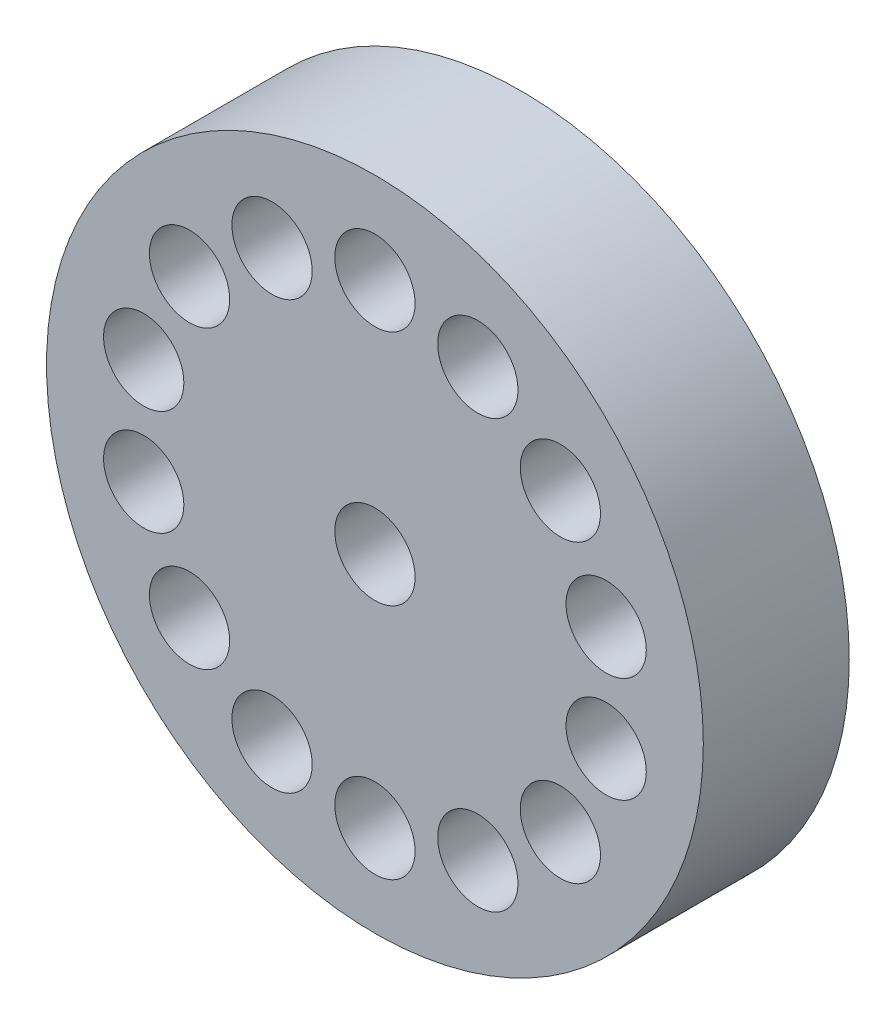
ISO-10303-21;
HEADER;
FILE_DESCRIPTION(('STEP AP214'),'2;1');
FILE_NAME('part.step','',(''),(''),'','','');
FILE_SCHEMA(('AUTOMOTIVE_DESIGN { 1 0 10303 214 1 1 1 1 }'));
ENDSEC;
DATA;
#1=APPLICATION_CONTEXT('core data for automotive mechanical design processes');
#2=APPLICATION_PROTOCOL_DEFINITION('international standard','automotive_design',2000,#1);
#3=PRODUCT_CONTEXT('',#1,'mechanical');
#4=PRODUCT('Part','Part','',(#3));
#5=PRODUCT_RELATED_PRODUCT_CATEGORY('part','',(#4));
#6=PRODUCT_DEFINITION_FORMATION('','',#4);
#7=PRODUCT_DEFINITION_CONTEXT('part definition',#1,'design');
#8=PRODUCT_DEFINITION('design','',#6,#7);
#9=PRODUCT_DEFINITION_SHAPE('','',#8);
#10=(LENGTH_UNIT() NAMED_UNIT(*) SI_UNIT(.MILLI.,.METRE.));
#11=(NAMED_UNIT(*) PLANE_ANGLE_UNIT() SI_UNIT($,.RADIAN.));
#12=(NAMED_UNIT(*) SI_UNIT($,.STERADIAN.) SOLID_ANGLE_UNIT());
#13=UNCERTAINTY_MEASURE_WITH_UNIT(LENGTH_MEASURE(1.E-05),#10,'distance_accuracy_value','');
#14=(GEOMETRIC_REPRESENTATION_CONTEXT(3) GLOBAL_UNCERTAINTY_ASSIGNED_CONTEXT((#13)) GLOBAL_UNIT_ASSIGNED_CONTEXT((#10,
#11,#12)) REPRESENTATION_CONTEXT('',''));
#15=CARTESIAN_POINT('',(0.,0.,0.));
#16=DIRECTION('',(0.,0.,1.));
#17=DIRECTION('',(1.,0.,0.));
#18=AXIS2_PLACEMENT_3D('',#15,#16,#17);
#19=CARTESIAN_POINT('',(0.,0.,2.));
#20=DIRECTION('',(0.,0.,1.));
#21=DIRECTION('',(1.,0.,0.));
#22=AXIS2_PLACEMENT_3D('',#19,#20,#21);
#23=PLANE('',#22);
#24=CARTESIAN_POINT('',(1.41012215213208,2.92814882068293,2.));
#25=DIRECTION('',(0.,0.,1.));
#26=DIRECTION('',(1.,0.,0.));
#27=AXIS2_PLACEMENT_3D('',#24,#25,#26);
#28=CIRCLE('',#27,0.55);
#29=CARTESIAN_POINT('',(1.96012215213208,2.92814882068293,2.));
#30=VERTEX_POINT('',#29);
#31=EDGE_CURVE('E99',#30,#30,#28,.T.);
#32=ORIENTED_EDGE('',*,*,#31,.F.);
#33=EDGE_LOOP('',(#32));
#34=FACE_BOUND('',#33,.T.);
#35=CARTESIAN_POINT('',(2.54095231802115,2.026341856041,2.));
#36=DIRECTION('',(0.,0.,1.));
#37=DIRECTION('',(1.,0.,0.));
#38=AXIS2_PLACEMENT_3D('',#35,#36,#37);
#39=CIRCLE('',#38,0.55);
#40=CARTESIAN_POINT('',(3.09095231802115,2.026341856041,2.));
#41=VERTEX_POINT('',#40);
#42=EDGE_CURVE('E93',#41,#41,#39,.T.);
#43=ORIENTED_EDGE('',*,*,#42,.F.);
#44=EDGE_LOOP('',(#43));
#45=FACE_BOUND('',#44,.T.);
#46=CARTESIAN_POINT('',(3.16851571459105,0.723193035358172,2.));
#47=DIRECTION('',(0.,0.,1.));
#48=DIRECTION('',(1.,0.,0.));
#49=AXIS2_PLACEMENT_3D('',#46,#47,#48);
#50=CIRCLE('',#49,0.55);
#51=CARTESIAN_POINT('',(3.71851571459105,0.723193035358172,2.));
#52=VERTEX_POINT('',#51);
#53=EDGE_CURVE('E87',#52,#52,#50,.T.);
#54=ORIENTED_EDGE('',*,*,#53,.F.);
#55=EDGE_LOOP('',(#54));
#56=FACE_BOUND('',#55,.T.);
#57=CARTESIAN_POINT('',(3.16851571459111,-0.723193035357872,2.));
#58=DIRECTION('',(0.,0.,1.));
#59=DIRECTION('',(1.,0.,0.));
#60=AXIS2_PLACEMENT_3D('',#57,#58,#59);
#61=CIRCLE('',#60,0.55);
#62=CARTESIAN_POINT('',(3.71851571459111,-0.723193035357872,2.));
#63=VERTEX_POINT('',#62);
#64=EDGE_CURVE('E81',#63,#63,#61,.T.);
#65=ORIENTED_EDGE('',*,*,#64,.F.);
#66=EDGE_LOOP('',(#65));
#67=FACE_BOUND('',#66,.T.);
#68=CARTESIAN_POINT('',(2.54095231802135,-2.02634185604076,2.));
#69=DIRECTION('',(0.,0.,1.));
#70=DIRECTION('',(1.,0.,0.));
#71=AXIS2_PLACEMENT_3D('',#68,#69,#70);
#72=CIRCLE('',#71,0.55);
#73=CARTESIAN_POINT('',(3.09095231802135,-2.02634185604076,2.));
#74=VERTEX_POINT('',#73);
#75=EDGE_CURVE('E75',#74,#74,#72,.T.);
#76=ORIENTED_EDGE('',*,*,#75,.F.);
#77=EDGE_LOOP('',(#76));
#78=FACE_BOUND('',#77,.T.);
#79=CARTESIAN_POINT('',(1.41012215213236,-2.9281488206828,2.));
#80=DIRECTION('',(0.,0.,1.));
#81=DIRECTION('',(1.,0.,0.));
#82=AXIS2_PLACEMENT_3D('',#79,#80,#81);
#83=CIRCLE('',#82,0.55);
#84=CARTESIAN_POINT('',(1.96012215213236,-2.9281488206828,2.));
#85=VERTEX_POINT('',#84);
#86=EDGE_CURVE('E69',#85,#85,#83,.T.);
#87=ORIENTED_EDGE('',*,*,#86,.F.);
#88=EDGE_LOOP('',(#87));
#89=FACE_BOUND('',#88,.T.);
#90=CARTESIAN_POINT('',(3.07708362406603E-13,-3.25,2.));
#91=DIRECTION('',(0.,0.,1.));
#92=DIRECTION('',(1.,0.,0.));
#93=AXIS2_PLACEMENT_3D('',#90,#91,#92);
#94=CIRCLE('',#93,0.55);
#95=CARTESIAN_POINT('',(0.550000000000308,-3.25,2.));
#96=VERTEX_POINT('',#95);
#97=EDGE_CURVE('E63',#96,#96,#94,.T.);
#98=ORIENTED_EDGE('',*,*,#97,.F.);
#99=EDGE_LOOP('',(#98));
#100=FACE_BOUND('',#99,.T.);
#101=CARTESIAN_POINT('',(-1.41012215213177,-2.92814882068293,2.));
#102=DIRECTION('',(0.,0.,1.));
#103=DIRECTION('',(1.,0.,0.));
#104=AXIS2_PLACEMENT_3D('',#101,#102,#103);
#105=CIRCLE('',#104,0.55);
#106=CARTESIAN_POINT('',(-0.860122152131771,-2.92814882068293,2.));
#107=VERTEX_POINT('',#106);
#108=EDGE_CURVE('E56',#107,#107,#105,.T.);
#109=ORIENTED_EDGE('',*,*,#108,.F.);
#110=EDGE_LOOP('',(#109));
#111=FACE_BOUND('',#110,.T.);
#112=CARTESIAN_POINT('',(-2.54095231802085,-2.026341856041,2.));
#113=DIRECTION('',(0.,0.,1.));
#114=DIRECTION('',(1.,0.,0.));
#115=AXIS2_PLACEMENT_3D('',#112,#113,#114);
#116=CIRCLE('',#115,0.55);
#117=CARTESIAN_POINT('',(-1.99095231802085,-2.026341856041,2.));
#118=VERTEX_POINT('',#117);
#119=EDGE_CURVE('E128',#118,#118,#116,.T.);
#120=ORIENTED_EDGE('',*,*,#119,.F.);
#121=EDGE_LOOP('',(#120));
#122=FACE_BOUND('',#121,.T.);
#123=CARTESIAN_POINT('',(-3.16851571459074,-0.723193035358172,2.));
#124=DIRECTION('',(0.,0.,1.));
#125=DIRECTION('',(1.,0.,0.));
#126=AXIS2_PLACEMENT_3D('',#123,#124,#125);
#127=CIRCLE('',#126,0.55);
#128=CARTESIAN_POINT('',(-2.61851571459074,-0.723193035358172,2.));
#129=VERTEX_POINT('',#128);
#130=EDGE_CURVE('E122',#129,#129,#127,.T.);
#131=ORIENTED_EDGE('',*,*,#130,.F.);
#132=EDGE_LOOP('',(#131));
#133=FACE_BOUND('',#132,.T.);
#134=CARTESIAN_POINT('',(-3.16851571459081,0.723193035357871,2.));
#135=DIRECTION('',(0.,0.,1.));
#136=DIRECTION('',(1.,0.,0.));
#137=AXIS2_PLACEMENT_3D('',#134,#135,#136);
#138=CIRCLE('',#137,0.55);
#139=CARTESIAN_POINT('',(-2.61851571459081,0.723193035357871,2.));
#140=VERTEX_POINT('',#139);
#141=EDGE_CURVE('E116',#140,#140,#138,.T.);
#142=ORIENTED_EDGE('',*,*,#141,.F.);
#143=EDGE_LOOP('',(#142));
#144=FACE_BOUND('',#143,.T.);
#145=CARTESIAN_POINT('',(-2.54095231802104,2.02634185604076,2.));
#146=DIRECTION('',(0.,0.,1.));
#147=DIRECTION('',(1.,0.,0.));
#148=AXIS2_PLACEMENT_3D('',#145,#146,#147);
#149=CIRCLE('',#148,0.55);
#150=CARTESIAN_POINT('',(-1.99095231802104,2.02634185604076,2.));
#151=VERTEX_POINT('',#150);
#152=EDGE_CURVE('E110',#151,#151,#149,.T.);
#153=ORIENTED_EDGE('',*,*,#152,.F.);
#154=EDGE_LOOP('',(#153));
#155=FACE_BOUND('',#154,.T.);
#156=CARTESIAN_POINT('',(-1.41012215213205,2.92814882068279,2.));
#157=DIRECTION('',(0.,0.,1.));
#158=DIRECTION('',(1.,0.,0.));
#159=AXIS2_PLACEMENT_3D('',#156,#157,#158);
#160=CIRCLE('',#159,0.55);
#161=CARTESIAN_POINT('',(-0.860122152132049,2.92814882068279,2.));
#162=VERTEX_POINT('',#161);
#163=EDGE_CURVE('E104',#162,#162,#160,.T.);
#164=ORIENTED_EDGE('',*,*,#163,.F.);
#165=EDGE_LOOP('',(#164));
#166=FACE_BOUND('',#165,.T.);
#167=CARTESIAN_POINT('',(0.,3.25,2.));
#168=DIRECTION('',(0.,0.,1.));
#169=DIRECTION('',(1.,0.,0.));
#170=AXIS2_PLACEMENT_3D('',#167,#168,#169);
#171=CIRCLE('',#170,0.55);
#172=CARTESIAN_POINT('',(0.55,3.25,2.));
#173=VERTEX_POINT('',#172);
#174=EDGE_CURVE('E50',#173,#173,#171,.T.);
#175=ORIENTED_EDGE('',*,*,#174,.F.);
#176=EDGE_LOOP('',(#175));
#177=FACE_BOUND('',#176,.T.);
#178=CARTESIAN_POINT('',(0.,0.,2.));
#179=DIRECTION('',(0.,0.,1.));
#180=DIRECTION('',(1.,0.,0.));
#181=AXIS2_PLACEMENT_3D('',#178,#179,#180);
#182=CIRCLE('',#181,4.5);
#183=CARTESIAN_POINT('',(4.5,0.,2.));
#184=VERTEX_POINT('',#183);
#185=EDGE_CURVE('E10',#184,#184,#182,.T.);
#186=ORIENTED_EDGE('',*,*,#185,.T.);
#187=EDGE_LOOP('',(#186));
#188=FACE_BOUND('',#187,.T.);
#189=CARTESIAN_POINT('',(0.,0.,2.));
#190=DIRECTION('',(0.,0.,1.));
#191=DIRECTION('',(1.,0.,0.));
#192=AXIS2_PLACEMENT_3D('',#189,#190,#191);
#193=CIRCLE('',#192,0.55);
#194=CARTESIAN_POINT('',(0.55,0.,2.));
#195=VERTEX_POINT('',#194);
#196=EDGE_CURVE('E42',#195,#195,#193,.T.);
#197=ORIENTED_EDGE('',*,*,#196,.F.);
#198=EDGE_LOOP('',(#197));
#199=FACE_BOUND('',#198,.T.);
#200=ADVANCED_FACE('F31',(#34,#45,#56,#67,#78,#89,#100,#111,#122,#133,#144,#155,#166,#177,#188,
#199),#23,.T.);
#201=CARTESIAN_POINT('',(0.,0.,0.));
#202=DIRECTION('',(0.,0.,1.));
#203=DIRECTION('',(1.,0.,0.));
#204=AXIS2_PLACEMENT_3D('',#201,#202,#203);
#205=PLANE('',#204);
#206=CARTESIAN_POINT('',(0.,0.,0.));
#207=DIRECTION('',(0.,0.,1.));
#208=DIRECTION('',(1.,0.,0.));
#209=AXIS2_PLACEMENT_3D('',#206,#207,#208);
#210=CIRCLE('',#209,4.5);
#211=CARTESIAN_POINT('',(4.5,0.,0.));
#212=VERTEX_POINT('',#211);
#213=EDGE_CURVE('E35',#212,#212,#210,.T.);
#214=ORIENTED_EDGE('',*,*,#213,.F.);
#215=EDGE_LOOP('',(#214));
#216=FACE_BOUND('',#215,.T.);
#217=CARTESIAN_POINT('',(0.,0.,0.));
#218=DIRECTION('',(0.,0.,1.));
#219=DIRECTION('',(1.,0.,0.));
#220=AXIS2_PLACEMENT_3D('',#217,#218,#219);
#221=CIRCLE('',#220,0.55);
#222=CARTESIAN_POINT('',(0.55,0.,0.));
#223=VERTEX_POINT('',#222);
#224=EDGE_CURVE('E44',#223,#223,#221,.T.);
#225=ORIENTED_EDGE('',*,*,#224,.T.);
#226=EDGE_LOOP('',(#225));
#227=FACE_BOUND('',#226,.T.);
#228=ADVANCED_FACE('F145',(#216,#227),#205,.F.);
#229=CARTESIAN_POINT('',(0.,0.,2.));
#230=DIRECTION('',(0.,0.,-1.));
#231=DIRECTION('',(-1.,0.,0.));
#232=AXIS2_PLACEMENT_3D('',#229,#230,#231);
#233=CYLINDRICAL_SURFACE('',#232,4.5);
#234=ORIENTED_EDGE('',*,*,#185,.F.);
#235=EDGE_LOOP('',(#234));
#236=FACE_BOUND('',#235,.T.);
#237=ORIENTED_EDGE('',*,*,#213,.T.);
#238=EDGE_LOOP('',(#237));
#239=FACE_BOUND('',#238,.T.);
#240=ADVANCED_FACE('F33',(#236,#239),#233,.T.);
#241=CARTESIAN_POINT('',(0.,0.,2.));
#242=DIRECTION('',(0.,0.,-1.));
#243=DIRECTION('',(-1.,0.,0.));
#244=AXIS2_PLACEMENT_3D('',#241,#242,#243);
#245=CYLINDRICAL_SURFACE('',#244,0.55);
#246=ORIENTED_EDGE('',*,*,#196,.T.);
#247=EDGE_LOOP('',(#246));
#248=FACE_BOUND('',#247,.T.);
#249=ORIENTED_EDGE('',*,*,#224,.F.);
#250=EDGE_LOOP('',(#249));
#251=FACE_BOUND('',#250,.T.);
#252=ADVANCED_FACE('F160',(#248,#251),#245,.F.);
#253=CARTESIAN_POINT('',(0.,3.25,1.));
#254=DIRECTION('',(0.,0.,1.));
#255=DIRECTION('',(1.,0.,0.));
#256=AXIS2_PLACEMENT_3D('',#253,#254,#255);
#257=CYLINDRICAL_SURFACE('',#256,0.55);
#258=CARTESIAN_POINT('',(0.,3.25,1.));
#259=DIRECTION('',(0.,0.,1.));
#260=DIRECTION('',(1.,0.,0.));
#261=AXIS2_PLACEMENT_3D('',#258,#259,#260);
#262=CIRCLE('',#261,0.55);
#263=CARTESIAN_POINT('',(0.55,3.25,1.));
#264=VERTEX_POINT('',#263);
#265=EDGE_CURVE('E47',#264,#264,#262,.T.);
#266=ORIENTED_EDGE('',*,*,#265,.F.);
#267=EDGE_LOOP('',(#266));
#268=FACE_BOUND('',#267,.T.);
#269=ORIENTED_EDGE('',*,*,#174,.T.);
#270=EDGE_LOOP('',(#269));
#271=FACE_BOUND('',#270,.T.);
#272=ADVANCED_FACE('F163',(#268,#271),#257,.F.);
#273=CARTESIAN_POINT('',(0.,3.25,1.));
#274=DIRECTION('',(0.,0.,1.));
#275=DIRECTION('',(1.,0.,0.));
#276=AXIS2_PLACEMENT_3D('',#273,#274,#275);
#277=PLANE('',#276);
#278=ORIENTED_EDGE('',*,*,#265,.T.);
#279=EDGE_LOOP('',(#278));
#280=FACE_BOUND('',#279,.T.);
#281=ADVANCED_FACE('F177',(#280),#277,.T.);
#282=CARTESIAN_POINT('',(-1.41012215213205,2.92814882068279,1.));
#283=DIRECTION('',(0.,0.,1.));
#284=DIRECTION('',(1.,0.,0.));
#285=AXIS2_PLACEMENT_3D('',#282,#283,#284);
#286=CYLINDRICAL_SURFACE('',#285,0.55);
#287=CARTESIAN_POINT('',(-1.41012215213205,2.92814882068279,1.));
#288=DIRECTION('',(0.,0.,1.));
#289=DIRECTION('',(1.,0.,0.));
#290=AXIS2_PLACEMENT_3D('',#287,#288,#289);
#291=CIRCLE('',#290,0.55);
#292=CARTESIAN_POINT('',(-0.860122152132049,2.92814882068279,1.));
#293=VERTEX_POINT('',#292);
#294=EDGE_CURVE('E107',#293,#293,#291,.T.);
#295=ORIENTED_EDGE('',*,*,#294,.F.);
#296=EDGE_LOOP('',(#295));
#297=FACE_BOUND('',#296,.T.);
#298=ORIENTED_EDGE('',*,*,#163,.T.);
#299=EDGE_LOOP('',(#298));
#300=FACE_BOUND('',#299,.T.);
#301=ADVANCED_FACE('F181',(#297,#300),#286,.F.);
#302=CARTESIAN_POINT('',(-1.41012215213205,2.92814882068279,1.));
#303=DIRECTION('',(0.,0.,1.));
#304=DIRECTION('',(1.,0.,0.));
#305=AXIS2_PLACEMENT_3D('',#302,#303,#304);
#306=PLANE('',#305);
#307=ORIENTED_EDGE('',*,*,#294,.T.);
#308=EDGE_LOOP('',(#307));
#309=FACE_BOUND('',#308,.T.);
#310=ADVANCED_FACE('F249',(#309),#306,.T.);
#311=CARTESIAN_POINT('',(-2.54095231802104,2.02634185604076,1.));
#312=DIRECTION('',(0.,0.,1.));
#313=DIRECTION('',(1.,0.,0.));
#314=AXIS2_PLACEMENT_3D('',#311,#312,#313);
#315=CYLINDRICAL_SURFACE('',#314,0.55);
#316=CARTESIAN_POINT('',(-2.54095231802104,2.02634185604076,1.));
#317=DIRECTION('',(0.,0.,1.));
#318=DIRECTION('',(1.,0.,0.));
#319=AXIS2_PLACEMENT_3D('',#316,#317,#318);
#320=CIRCLE('',#319,0.55);
#321=CARTESIAN_POINT('',(-1.99095231802104,2.02634185604076,1.));
#322=VERTEX_POINT('',#321);
#323=EDGE_CURVE('E113',#322,#322,#320,.T.);
#324=ORIENTED_EDGE('',*,*,#323,.F.);
#325=EDGE_LOOP('',(#324));
#326=FACE_BOUND('',#325,.T.);
#327=ORIENTED_EDGE('',*,*,#152,.T.);
#328=EDGE_LOOP('',(#327));
#329=FACE_BOUND('',#328,.T.);
#330=ADVANCED_FACE('F253',(#326,#329),#315,.F.);
#331=CARTESIAN_POINT('',(-2.54095231802104,2.02634185604076,1.));
#332=DIRECTION('',(0.,0.,1.));
#333=DIRECTION('',(1.,0.,0.));
#334=AXIS2_PLACEMENT_3D('',#331,#332,#333);
#335=PLANE('',#334);
#336=ORIENTED_EDGE('',*,*,#323,.T.);
#337=EDGE_LOOP('',(#336));
#338=FACE_BOUND('',#337,.T.);
#339=ADVANCED_FACE('F257',(#338),#335,.T.);
#340=CARTESIAN_POINT('',(-3.16851571459081,0.723193035357871,1.));
#341=DIRECTION('',(0.,0.,1.));
#342=DIRECTION('',(1.,0.,0.));
#343=AXIS2_PLACEMENT_3D('',#340,#341,#342);
#344=CYLINDRICAL_SURFACE('',#343,0.55);
#345=CARTESIAN_POINT('',(-3.16851571459081,0.723193035357871,1.));
#346=DIRECTION('',(0.,0.,1.));
#347=DIRECTION('',(1.,0.,0.));
#348=AXIS2_PLACEMENT_3D('',#345,#346,#347);
#349=CIRCLE('',#348,0.55);
#350=CARTESIAN_POINT('',(-2.61851571459081,0.723193035357871,1.));
#351=VERTEX_POINT('',#350);
#352=EDGE_CURVE('E119',#351,#351,#349,.T.);
#353=ORIENTED_EDGE('',*,*,#352,.F.);
#354=EDGE_LOOP('',(#353));
#355=FACE_BOUND('',#354,.T.);
#356=ORIENTED_EDGE('',*,*,#141,.T.);
#357=EDGE_LOOP('',(#356));
#358=FACE_BOUND('',#357,.T.);
#359=ADVANCED_FACE('F261',(#355,#358),#344,.F.);
#360=CARTESIAN_POINT('',(-3.16851571459081,0.723193035357871,1.));
#361=DIRECTION('',(0.,0.,1.));
#362=DIRECTION('',(1.,0.,0.));
#363=AXIS2_PLACEMENT_3D('',#360,#361,#362);
#364=PLANE('',#363);
#365=ORIENTED_EDGE('',*,*,#352,.T.);
#366=EDGE_LOOP('',(#365));
#367=FACE_BOUND('',#366,.T.);
#368=ADVANCED_FACE('F265',(#367),#364,.T.);
#369=CARTESIAN_POINT('',(-3.16851571459074,-0.723193035358172,1.));
#370=DIRECTION('',(0.,0.,1.));
#371=DIRECTION('',(1.,0.,0.));
#372=AXIS2_PLACEMENT_3D('',#369,#370,#371);
#373=CYLINDRICAL_SURFACE('',#372,0.55);
#374=CARTESIAN_POINT('',(-3.16851571459074,-0.723193035358172,1.));
#375=DIRECTION('',(0.,0.,1.));
#376=DIRECTION('',(1.,0.,0.));
#377=AXIS2_PLACEMENT_3D('',#374,#375,#376);
#378=CIRCLE('',#377,0.55);
#379=CARTESIAN_POINT('',(-2.61851571459074,-0.723193035358172,1.));
#380=VERTEX_POINT('',#379);
#381=EDGE_CURVE('E125',#380,#380,#378,.T.);
#382=ORIENTED_EDGE('',*,*,#381,.F.);
#383=EDGE_LOOP('',(#382));
#384=FACE_BOUND('',#383,.T.);
#385=ORIENTED_EDGE('',*,*,#130,.T.);
#386=EDGE_LOOP('',(#385));
#387=FACE_BOUND('',#386,.T.);
#388=ADVANCED_FACE('F269',(#384,#387),#373,.F.);
#389=CARTESIAN_POINT('',(-3.16851571459074,-0.723193035358172,1.));
#390=DIRECTION('',(0.,0.,1.));
#391=DIRECTION('',(1.,0.,0.));
#392=AXIS2_PLACEMENT_3D('',#389,#390,#391);
#393=PLANE('',#392);
#394=ORIENTED_EDGE('',*,*,#381,.T.);
#395=EDGE_LOOP('',(#394));
#396=FACE_BOUND('',#395,.T.);
#397=ADVANCED_FACE('F139',(#396),#393,.T.);
#398=CARTESIAN_POINT('',(-2.54095231802085,-2.026341856041,1.));
#399=DIRECTION('',(0.,0.,1.));
#400=DIRECTION('',(1.,0.,0.));
#401=AXIS2_PLACEMENT_3D('',#398,#399,#400);
#402=CYLINDRICAL_SURFACE('',#401,0.55);
#403=CARTESIAN_POINT('',(-2.54095231802085,-2.026341856041,1.));
#404=DIRECTION('',(0.,0.,1.));
#405=DIRECTION('',(1.,0.,0.));
#406=AXIS2_PLACEMENT_3D('',#403,#404,#405);
#407=CIRCLE('',#406,0.55);
#408=CARTESIAN_POINT('',(-1.99095231802085,-2.026341856041,1.));
#409=VERTEX_POINT('',#408);
#410=EDGE_CURVE('E60',#409,#409,#407,.T.);
#411=ORIENTED_EDGE('',*,*,#410,.F.);
#412=EDGE_LOOP('',(#411));
#413=FACE_BOUND('',#412,.T.);
#414=ORIENTED_EDGE('',*,*,#119,.T.);
#415=EDGE_LOOP('',(#414));
#416=FACE_BOUND('',#415,.T.);
#417=ADVANCED_FACE('F136',(#413,#416),#402,.F.);
#418=CARTESIAN_POINT('',(-2.54095231802085,-2.026341856041,1.));
#419=DIRECTION('',(0.,0.,1.));
#420=DIRECTION('',(1.,0.,0.));
#421=AXIS2_PLACEMENT_3D('',#418,#419,#420);
#422=PLANE('',#421);
#423=ORIENTED_EDGE('',*,*,#410,.T.);
#424=EDGE_LOOP('',(#423));
#425=FACE_BOUND('',#424,.T.);
#426=ADVANCED_FACE('F134',(#425),#422,.T.);
#427=CARTESIAN_POINT('',(-1.41012215213177,-2.92814882068293,1.));
#428=DIRECTION('',(0.,0.,1.));
#429=DIRECTION('',(1.,0.,0.));
#430=AXIS2_PLACEMENT_3D('',#427,#428,#429);
#431=CYLINDRICAL_SURFACE('',#430,0.55);
#432=CARTESIAN_POINT('',(-1.41012215213177,-2.92814882068293,1.));
#433=DIRECTION('',(0.,0.,1.));
#434=DIRECTION('',(1.,0.,0.));
#435=AXIS2_PLACEMENT_3D('',#432,#433,#434);
#436=CIRCLE('',#435,0.55);
#437=CARTESIAN_POINT('',(-0.860122152131771,-2.92814882068293,1.));
#438=VERTEX_POINT('',#437);
#439=EDGE_CURVE('E59',#438,#438,#436,.T.);
#440=ORIENTED_EDGE('',*,*,#439,.F.);
#441=EDGE_LOOP('',(#440));
#442=FACE_BOUND('',#441,.T.);
#443=ORIENTED_EDGE('',*,*,#108,.T.);
#444=EDGE_LOOP('',(#443));
#445=FACE_BOUND('',#444,.T.);
#446=ADVANCED_FACE('F183',(#442,#445),#431,.F.);
#447=CARTESIAN_POINT('',(-1.41012215213177,-2.92814882068293,1.));
#448=DIRECTION('',(0.,0.,1.));
#449=DIRECTION('',(1.,0.,0.));
#450=AXIS2_PLACEMENT_3D('',#447,#448,#449);
#451=PLANE('',#450);
#452=ORIENTED_EDGE('',*,*,#439,.T.);
#453=EDGE_LOOP('',(#452));
#454=FACE_BOUND('',#453,.T.);
#455=ADVANCED_FACE('F186',(#454),#451,.T.);
#456=CARTESIAN_POINT('',(3.07708362406603E-13,-3.25,1.));
#457=DIRECTION('',(0.,0.,1.));
#458=DIRECTION('',(1.,0.,0.));
#459=AXIS2_PLACEMENT_3D('',#456,#457,#458);
#460=CYLINDRICAL_SURFACE('',#459,0.55);
#461=CARTESIAN_POINT('',(3.07708362406603E-13,-3.25,1.));
#462=DIRECTION('',(0.,0.,1.));
#463=DIRECTION('',(1.,0.,0.));
#464=AXIS2_PLACEMENT_3D('',#461,#462,#463);
#465=CIRCLE('',#464,0.55);
#466=CARTESIAN_POINT('',(0.550000000000308,-3.25,1.));
#467=VERTEX_POINT('',#466);
#468=EDGE_CURVE('E66',#467,#467,#465,.T.);
#469=ORIENTED_EDGE('',*,*,#468,.F.);
#470=EDGE_LOOP('',(#469));
#471=FACE_BOUND('',#470,.T.);
#472=ORIENTED_EDGE('',*,*,#97,.T.);
#473=EDGE_LOOP('',(#472));
#474=FACE_BOUND('',#473,.T.);
#475=ADVANCED_FACE('F190',(#471,#474),#460,.F.);
#476=CARTESIAN_POINT('',(3.07708362406603E-13,-3.25,1.));
#477=DIRECTION('',(0.,0.,1.));
#478=DIRECTION('',(1.,0.,0.));
#479=AXIS2_PLACEMENT_3D('',#476,#477,#478);
#480=PLANE('',#479);
#481=ORIENTED_EDGE('',*,*,#468,.T.);
#482=EDGE_LOOP('',(#481));
#483=FACE_BOUND('',#482,.T.);
#484=ADVANCED_FACE('F194',(#483),#480,.T.);
#485=CARTESIAN_POINT('',(1.41012215213236,-2.9281488206828,1.));
#486=DIRECTION('',(0.,0.,1.));
#487=DIRECTION('',(1.,0.,0.));
#488=AXIS2_PLACEMENT_3D('',#485,#486,#487);
#489=CYLINDRICAL_SURFACE('',#488,0.55);
#490=CARTESIAN_POINT('',(1.41012215213236,-2.9281488206828,1.));
#491=DIRECTION('',(0.,0.,1.));
#492=DIRECTION('',(1.,0.,0.));
#493=AXIS2_PLACEMENT_3D('',#490,#491,#492);
#494=CIRCLE('',#493,0.55);
#495=CARTESIAN_POINT('',(1.96012215213236,-2.9281488206828,1.));
#496=VERTEX_POINT('',#495);
#497=EDGE_CURVE('E72',#496,#496,#494,.T.);
#498=ORIENTED_EDGE('',*,*,#497,.F.);
#499=EDGE_LOOP('',(#498));
#500=FACE_BOUND('',#499,.T.);
#501=ORIENTED_EDGE('',*,*,#86,.T.);
#502=EDGE_LOOP('',(#501));
#503=FACE_BOUND('',#502,.T.);
#504=ADVANCED_FACE('F198',(#500,#503),#489,.F.);
#505=CARTESIAN_POINT('',(1.41012215213236,-2.9281488206828,1.));
#506=DIRECTION('',(0.,0.,1.));
#507=DIRECTION('',(1.,0.,0.));
#508=AXIS2_PLACEMENT_3D('',#505,#506,#507);
#509=PLANE('',#508);
#510=ORIENTED_EDGE('',*,*,#497,.T.);
#511=EDGE_LOOP('',(#510));
#512=FACE_BOUND('',#511,.T.);
#513=ADVANCED_FACE('F202',(#512),#509,.T.);
#514=CARTESIAN_POINT('',(2.54095231802135,-2.02634185604076,1.));
#515=DIRECTION('',(0.,0.,1.));
#516=DIRECTION('',(1.,0.,0.));
#517=AXIS2_PLACEMENT_3D('',#514,#515,#516);
#518=CYLINDRICAL_SURFACE('',#517,0.55);
#519=CARTESIAN_POINT('',(2.54095231802135,-2.02634185604076,1.));
#520=DIRECTION('',(0.,0.,1.));
#521=DIRECTION('',(1.,0.,0.));
#522=AXIS2_PLACEMENT_3D('',#519,#520,#521);
#523=CIRCLE('',#522,0.55);
#524=CARTESIAN_POINT('',(3.09095231802135,-2.02634185604076,1.));
#525=VERTEX_POINT('',#524);
#526=EDGE_CURVE('E78',#525,#525,#523,.T.);
#527=ORIENTED_EDGE('',*,*,#526,.F.);
#528=EDGE_LOOP('',(#527));
#529=FACE_BOUND('',#528,.T.);
#530=ORIENTED_EDGE('',*,*,#75,.T.);
#531=EDGE_LOOP('',(#530));
#532=FACE_BOUND('',#531,.T.);
#533=ADVANCED_FACE('F206',(#529,#532),#518,.F.);
#534=CARTESIAN_POINT('',(2.54095231802135,-2.02634185604076,1.));
#535=DIRECTION('',(0.,0.,1.));
#536=DIRECTION('',(1.,0.,0.));
#537=AXIS2_PLACEMENT_3D('',#534,#535,#536);
#538=PLANE('',#537);
#539=ORIENTED_EDGE('',*,*,#526,.T.);
#540=EDGE_LOOP('',(#539));
#541=FACE_BOUND('',#540,.T.);
#542=ADVANCED_FACE('F210',(#541),#538,.T.);
#543=CARTESIAN_POINT('',(3.16851571459111,-0.723193035357872,1.));
#544=DIRECTION('',(0.,0.,1.));
#545=DIRECTION('',(1.,0.,0.));
#546=AXIS2_PLACEMENT_3D('',#543,#544,#545);
#547=CYLINDRICAL_SURFACE('',#546,0.55);
#548=CARTESIAN_POINT('',(3.16851571459111,-0.723193035357872,1.));
#549=DIRECTION('',(0.,0.,1.));
#550=DIRECTION('',(1.,0.,0.));
#551=AXIS2_PLACEMENT_3D('',#548,#549,#550);
#552=CIRCLE('',#551,0.55);
#553=CARTESIAN_POINT('',(3.71851571459111,-0.723193035357872,1.));
#554=VERTEX_POINT('',#553);
#555=EDGE_CURVE('E84',#554,#554,#552,.T.);
#556=ORIENTED_EDGE('',*,*,#555,.F.);
#557=EDGE_LOOP('',(#556));
#558=FACE_BOUND('',#557,.T.);
#559=ORIENTED_EDGE('',*,*,#64,.T.);
#560=EDGE_LOOP('',(#559));
#561=FACE_BOUND('',#560,.T.);
#562=ADVANCED_FACE('F214',(#558,#561),#547,.F.);
#563=CARTESIAN_POINT('',(3.16851571459111,-0.723193035357872,1.));
#564=DIRECTION('',(0.,0.,1.));
#565=DIRECTION('',(1.,0.,0.));
#566=AXIS2_PLACEMENT_3D('',#563,#564,#565);
#567=PLANE('',#566);
#568=ORIENTED_EDGE('',*,*,#555,.T.);
#569=EDGE_LOOP('',(#568));
#570=FACE_BOUND('',#569,.T.);
#571=ADVANCED_FACE('F218',(#570),#567,.T.);
#572=CARTESIAN_POINT('',(3.16851571459105,0.723193035358172,1.));
#573=DIRECTION('',(0.,0.,1.));
#574=DIRECTION('',(1.,0.,0.));
#575=AXIS2_PLACEMENT_3D('',#572,#573,#574);
#576=CYLINDRICAL_SURFACE('',#575,0.55);
#577=CARTESIAN_POINT('',(3.16851571459105,0.723193035358172,1.));
#578=DIRECTION('',(0.,0.,1.));
#579=DIRECTION('',(1.,0.,0.));
#580=AXIS2_PLACEMENT_3D('',#577,#578,#579);
#581=CIRCLE('',#580,0.55);
#582=CARTESIAN_POINT('',(3.71851571459105,0.723193035358172,1.));
#583=VERTEX_POINT('',#582);
#584=EDGE_CURVE('E90',#583,#583,#581,.T.);
#585=ORIENTED_EDGE('',*,*,#584,.F.);
#586=EDGE_LOOP('',(#585));
#587=FACE_BOUND('',#586,.T.);
#588=ORIENTED_EDGE('',*,*,#53,.T.);
#589=EDGE_LOOP('',(#588));
#590=FACE_BOUND('',#589,.T.);
#591=ADVANCED_FACE('F222',(#587,#590),#576,.F.);
#592=CARTESIAN_POINT('',(3.16851571459105,0.723193035358172,1.));
#593=DIRECTION('',(0.,0.,1.));
#594=DIRECTION('',(1.,0.,0.));
#595=AXIS2_PLACEMENT_3D('',#592,#593,#594);
#596=PLANE('',#595);
#597=ORIENTED_EDGE('',*,*,#584,.T.);
#598=EDGE_LOOP('',(#597));
#599=FACE_BOUND('',#598,.T.);
#600=ADVANCED_FACE('F226',(#599),#596,.T.);
#601=CARTESIAN_POINT('',(2.54095231802115,2.026341856041,1.));
#602=DIRECTION('',(0.,0.,1.));
#603=DIRECTION('',(1.,0.,0.));
#604=AXIS2_PLACEMENT_3D('',#601,#602,#603);
#605=CYLINDRICAL_SURFACE('',#604,0.55);
#606=CARTESIAN_POINT('',(2.54095231802115,2.026341856041,1.));
#607=DIRECTION('',(0.,0.,1.));
#608=DIRECTION('',(1.,0.,0.));
#609=AXIS2_PLACEMENT_3D('',#606,#607,#608);
#610=CIRCLE('',#609,0.55);
#611=CARTESIAN_POINT('',(3.09095231802115,2.026341856041,1.));
#612=VERTEX_POINT('',#611);
#613=EDGE_CURVE('E96',#612,#612,#610,.T.);
#614=ORIENTED_EDGE('',*,*,#613,.F.);
#615=EDGE_LOOP('',(#614));
#616=FACE_BOUND('',#615,.T.);
#617=ORIENTED_EDGE('',*,*,#42,.T.);
#618=EDGE_LOOP('',(#617));
#619=FACE_BOUND('',#618,.T.);
#620=ADVANCED_FACE('F230',(#616,#619),#605,.F.);
#621=CARTESIAN_POINT('',(2.54095231802115,2.026341856041,1.));
#622=DIRECTION('',(0.,0.,1.));
#623=DIRECTION('',(1.,0.,0.));
#624=AXIS2_PLACEMENT_3D('',#621,#622,#623);
#625=PLANE('',#624);
#626=ORIENTED_EDGE('',*,*,#613,.T.);
#627=EDGE_LOOP('',(#626));
#628=FACE_BOUND('',#627,.T.);
#629=ADVANCED_FACE('F234',(#628),#625,.T.);
#630=CARTESIAN_POINT('',(1.41012215213208,2.92814882068293,1.));
#631=DIRECTION('',(0.,0.,1.));
#632=DIRECTION('',(1.,0.,0.));
#633=AXIS2_PLACEMENT_3D('',#630,#631,#632);
#634=CYLINDRICAL_SURFACE('',#633,0.55);
#635=CARTESIAN_POINT('',(1.41012215213208,2.92814882068293,1.));
#636=DIRECTION('',(0.,0.,1.));
#637=DIRECTION('',(1.,0.,0.));
#638=AXIS2_PLACEMENT_3D('',#635,#636,#637);
#639=CIRCLE('',#638,0.55);
#640=CARTESIAN_POINT('',(1.96012215213208,2.92814882068293,1.));
#641=VERTEX_POINT('',#640);
#642=EDGE_CURVE('E53',#641,#641,#639,.T.);
#643=ORIENTED_EDGE('',*,*,#642,.F.);
#644=EDGE_LOOP('',(#643));
#645=FACE_BOUND('',#644,.T.);
#646=ORIENTED_EDGE('',*,*,#31,.T.);
#647=EDGE_LOOP('',(#646));
#648=FACE_BOUND('',#647,.T.);
#649=ADVANCED_FACE('F238',(#645,#648),#634,.F.);
#650=CARTESIAN_POINT('',(1.41012215213208,2.92814882068293,1.));
#651=DIRECTION('',(0.,0.,1.));
#652=DIRECTION('',(1.,0.,0.));
#653=AXIS2_PLACEMENT_3D('',#650,#651,#652);
#654=PLANE('',#653);
#655=ORIENTED_EDGE('',*,*,#642,.T.);
#656=EDGE_LOOP('',(#655));
#657=FACE_BOUND('',#656,.T.);
#658=ADVANCED_FACE('F242',(#657),#654,.T.);
#659=CLOSED_SHELL('',(#200,#228,#240,#252,#272,#281,#301,#310,#330,#339,#359,#368,#388,#397,
#417,#426,#446,#455,#475,#484,#504,#513,#533,#542,#562,#571,#591,#600,#620,#629,#649,#658));
#660=MANIFOLD_SOLID_BREP('B2',#659);
#661=ADVANCED_BREP_SHAPE_REPRESENTATION('',(#18,#660),#14);
#662=SHAPE_DEFINITION_REPRESENTATION(#9,#661);
ENDSEC;
END-ISO-10303-21;
